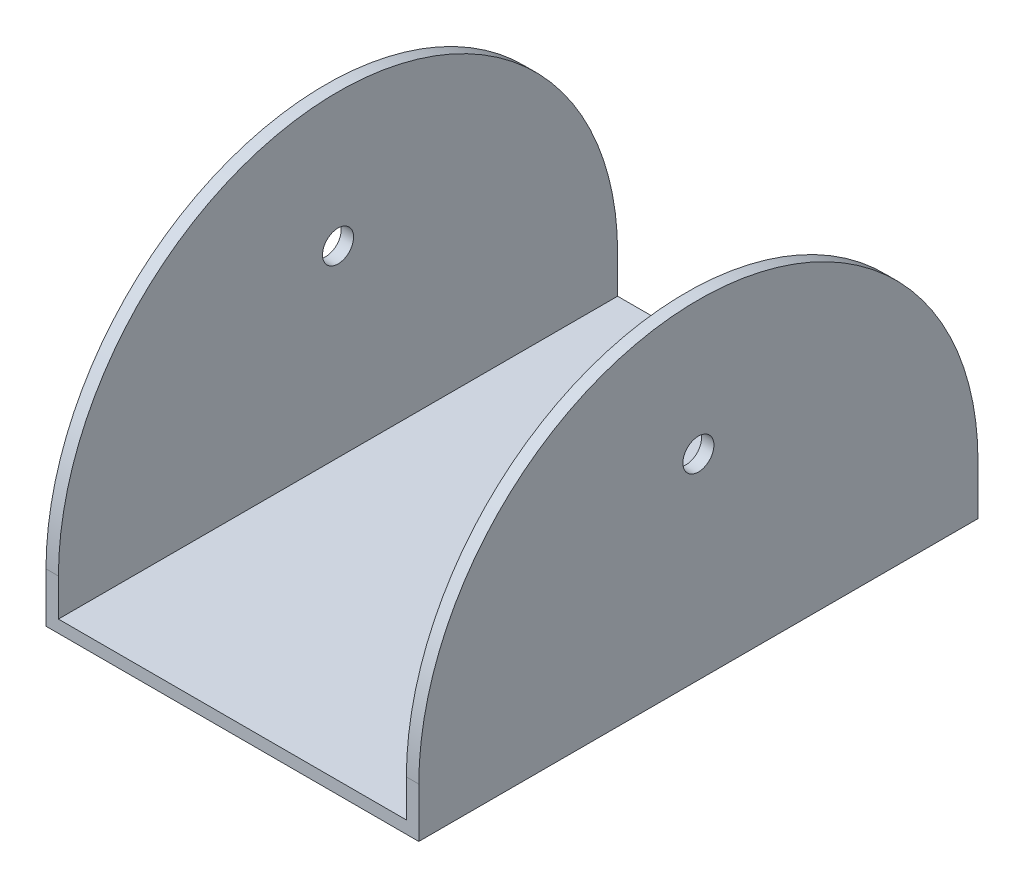
ISO-10303-21;
HEADER;
FILE_DESCRIPTION(('STEP AP214'),'2;1');
FILE_NAME('part.step','',(''),(''),'','','');
FILE_SCHEMA(('AUTOMOTIVE_DESIGN { 1 0 10303 214 1 1 1 1 }'));
ENDSEC;
DATA;
#1=APPLICATION_CONTEXT('core data for automotive mechanical design processes');
#2=APPLICATION_PROTOCOL_DEFINITION('international standard','automotive_design',2000,#1);
#3=PRODUCT_CONTEXT('',#1,'mechanical');
#4=PRODUCT('Part','Part','',(#3));
#5=PRODUCT_RELATED_PRODUCT_CATEGORY('part','',(#4));
#6=PRODUCT_DEFINITION_FORMATION('','',#4);
#7=PRODUCT_DEFINITION_CONTEXT('part definition',#1,'design');
#8=PRODUCT_DEFINITION('design','',#6,#7);
#9=PRODUCT_DEFINITION_SHAPE('','',#8);
#10=(LENGTH_UNIT() NAMED_UNIT(*) SI_UNIT(.MILLI.,.METRE.));
#11=(NAMED_UNIT(*) PLANE_ANGLE_UNIT() SI_UNIT($,.RADIAN.));
#12=(NAMED_UNIT(*) SI_UNIT($,.STERADIAN.) SOLID_ANGLE_UNIT());
#13=UNCERTAINTY_MEASURE_WITH_UNIT(LENGTH_MEASURE(1.E-05),#10,'distance_accuracy_value','');
#14=(GEOMETRIC_REPRESENTATION_CONTEXT(3) GLOBAL_UNCERTAINTY_ASSIGNED_CONTEXT((#13)) GLOBAL_UNIT_ASSIGNED_CONTEXT((#10,
#11,#12)) REPRESENTATION_CONTEXT('',''));
#15=CARTESIAN_POINT('',(0.,0.,0.));
#16=DIRECTION('',(0.,0.,1.));
#17=DIRECTION('',(1.,0.,0.));
#18=AXIS2_PLACEMENT_3D('',#15,#16,#17);
#19=CARTESIAN_POINT('',(-30.,-4.98349643765029,-45.));
#20=DIRECTION('',(-1.,0.,0.));
#21=DIRECTION('',(0.,-1.,0.));
#22=AXIS2_PLACEMENT_3D('',#19,#20,#21);
#23=PLANE('',#22);
#24=CARTESIAN_POINT('',(-30.,26.5165035623497,0.));
#25=DIRECTION('',(-1.,0.,0.));
#26=DIRECTION('',(0.,0.,1.));
#27=AXIS2_PLACEMENT_3D('',#24,#25,#26);
#28=CIRCLE('',#27,2.5);
#29=CARTESIAN_POINT('',(-30.,26.5165035623497,2.5));
#30=VERTEX_POINT('',#29);
#31=EDGE_CURVE('E206',#30,#30,#28,.T.);
#32=ORIENTED_EDGE('',*,*,#31,.F.);
#33=EDGE_LOOP('',(#32));
#34=FACE_BOUND('',#33,.T.);
#35=CARTESIAN_POINT('',(-30.,3.0165035623497,0.));
#36=DIRECTION('',(1.,0.,0.));
#37=DIRECTION('',(0.,1.,0.));
#38=AXIS2_PLACEMENT_3D('',#35,#36,#37);
#39=CIRCLE('',#38,45.);
#40=CARTESIAN_POINT('',(-30.,3.0165035623497,45.));
#41=VERTEX_POINT('',#40);
#42=CARTESIAN_POINT('',(-30.,3.0165035623497,-45.));
#43=VERTEX_POINT('',#42);
#44=EDGE_CURVE('E60',#41,#43,#39,.F.);
#45=ORIENTED_EDGE('',*,*,#44,.T.);
#46=DIRECTION('',(0.,-1.,0.));
#47=VECTOR('',#46,1.);
#48=CARTESIAN_POINT('',(-30.,-4.98349643765029,-45.));
#49=LINE('',#48,#47);
#50=CARTESIAN_POINT('',(-30.,-4.98349643765029,-45.));
#51=VERTEX_POINT('',#50);
#52=EDGE_CURVE('E103',#43,#51,#49,.T.);
#53=ORIENTED_EDGE('',*,*,#52,.T.);
#54=DIRECTION('',(0.,0.,1.));
#55=VECTOR('',#54,1.);
#56=CARTESIAN_POINT('',(-30.,-4.98349643765029,-45.));
#57=LINE('',#56,#55);
#58=CARTESIAN_POINT('',(-30.,-4.98349643765029,45.));
#59=VERTEX_POINT('',#58);
#60=EDGE_CURVE('E152',#51,#59,#57,.T.);
#61=ORIENTED_EDGE('',*,*,#60,.T.);
#62=DIRECTION('',(0.,-1.,0.));
#63=VECTOR('',#62,1.);
#64=CARTESIAN_POINT('',(-30.,-4.98349643765029,45.));
#65=LINE('',#64,#63);
#66=EDGE_CURVE('E105',#41,#59,#65,.T.);
#67=ORIENTED_EDGE('',*,*,#66,.F.);
#68=EDGE_LOOP('',(#45,#53,#61,#67));
#69=FACE_BOUND('',#68,.T.);
#70=ADVANCED_FACE('F38',(#34,#69),#23,.T.);
#71=CARTESIAN_POINT('',(-28.,48.0165035623497,-45.));
#72=DIRECTION('',(1.,0.,0.));
#73=DIRECTION('',(0.,1.,0.));
#74=AXIS2_PLACEMENT_3D('',#71,#72,#73);
#75=PLANE('',#74);
#76=CARTESIAN_POINT('',(-28.,26.5165035623497,0.));
#77=DIRECTION('',(1.,0.,0.));
#78=DIRECTION('',(0.,1.,0.));
#79=AXIS2_PLACEMENT_3D('',#76,#77,#78);
#80=CIRCLE('',#79,2.5);
#81=CARTESIAN_POINT('',(-28.,29.0165035623497,0.));
#82=VERTEX_POINT('',#81);
#83=EDGE_CURVE('E119',#82,#82,#80,.T.);
#84=ORIENTED_EDGE('',*,*,#83,.F.);
#85=EDGE_LOOP('',(#84));
#86=FACE_BOUND('',#85,.T.);
#87=DIRECTION('',(0.,1.,0.));
#88=VECTOR('',#87,1.);
#89=CARTESIAN_POINT('',(-28.,48.0165035623497,-45.));
#90=LINE('',#89,#88);
#91=CARTESIAN_POINT('',(-28.,-2.98349643765029,-45.));
#92=VERTEX_POINT('',#91);
#93=CARTESIAN_POINT('',(-28.,3.0165035623497,-45.));
#94=VERTEX_POINT('',#93);
#95=EDGE_CURVE('E149',#92,#94,#90,.T.);
#96=ORIENTED_EDGE('',*,*,#95,.T.);
#97=CARTESIAN_POINT('',(-28.,3.0165035623497,0.));
#98=DIRECTION('',(1.,0.,0.));
#99=DIRECTION('',(0.,1.,0.));
#100=AXIS2_PLACEMENT_3D('',#97,#98,#99);
#101=CIRCLE('',#100,45.);
#102=CARTESIAN_POINT('',(-28.,3.0165035623497,45.));
#103=VERTEX_POINT('',#102);
#104=EDGE_CURVE('E114',#103,#94,#101,.F.);
#105=ORIENTED_EDGE('',*,*,#104,.F.);
#106=DIRECTION('',(0.,1.,0.));
#107=VECTOR('',#106,1.);
#108=CARTESIAN_POINT('',(-28.,48.0165035623497,45.));
#109=LINE('',#108,#107);
#110=CARTESIAN_POINT('',(-28.,-2.98349643765029,45.));
#111=VERTEX_POINT('',#110);
#112=EDGE_CURVE('E128',#111,#103,#109,.T.);
#113=ORIENTED_EDGE('',*,*,#112,.F.);
#114=DIRECTION('',(0.,0.,1.));
#115=VECTOR('',#114,1.);
#116=CARTESIAN_POINT('',(-28.,-2.98349643765029,-45.));
#117=LINE('',#116,#115);
#118=EDGE_CURVE('E153',#92,#111,#117,.T.);
#119=ORIENTED_EDGE('',*,*,#118,.F.);
#120=EDGE_LOOP('',(#96,#105,#113,#119));
#121=FACE_BOUND('',#120,.T.);
#122=ADVANCED_FACE('F237',(#86,#121),#75,.T.);
#123=CARTESIAN_POINT('',(28.,48.0165035623497,-45.));
#124=DIRECTION('',(-1.,0.,0.));
#125=DIRECTION('',(0.,-1.,0.));
#126=AXIS2_PLACEMENT_3D('',#123,#124,#125);
#127=PLANE('',#126);
#128=CARTESIAN_POINT('',(28.,26.5165035623497,0.));
#129=DIRECTION('',(-1.,0.,0.));
#130=DIRECTION('',(0.,-1.,0.));
#131=AXIS2_PLACEMENT_3D('',#128,#129,#130);
#132=CIRCLE('',#131,2.5);
#133=CARTESIAN_POINT('',(28.,24.0165035623497,0.));
#134=VERTEX_POINT('',#133);
#135=EDGE_CURVE('E201',#134,#134,#132,.T.);
#136=ORIENTED_EDGE('',*,*,#135,.F.);
#137=EDGE_LOOP('',(#136));
#138=FACE_BOUND('',#137,.T.);
#139=CARTESIAN_POINT('',(28.,3.01650356234972,0.));
#140=DIRECTION('',(-1.,0.,0.));
#141=DIRECTION('',(0.,-1.,0.));
#142=AXIS2_PLACEMENT_3D('',#139,#140,#141);
#143=CIRCLE('',#142,45.);
#144=CARTESIAN_POINT('',(28.,3.01650356234972,-45.));
#145=VERTEX_POINT('',#144);
#146=CARTESIAN_POINT('',(28.,3.01650356234971,45.));
#147=VERTEX_POINT('',#146);
#148=EDGE_CURVE('E52',#145,#147,#143,.F.);
#149=ORIENTED_EDGE('',*,*,#148,.F.);
#150=DIRECTION('',(0.,-1.,0.));
#151=VECTOR('',#150,1.);
#152=CARTESIAN_POINT('',(28.,48.0165035623497,-45.));
#153=LINE('',#152,#151);
#154=CARTESIAN_POINT('',(28.,-2.98349643765028,-45.));
#155=VERTEX_POINT('',#154);
#156=EDGE_CURVE('E142',#145,#155,#153,.T.);
#157=ORIENTED_EDGE('',*,*,#156,.T.);
#158=DIRECTION('',(0.,0.,1.));
#159=VECTOR('',#158,1.);
#160=CARTESIAN_POINT('',(28.,-2.98349643765028,-45.));
#161=LINE('',#160,#159);
#162=CARTESIAN_POINT('',(28.,-2.98349643765028,45.));
#163=VERTEX_POINT('',#162);
#164=EDGE_CURVE('E156',#155,#163,#161,.T.);
#165=ORIENTED_EDGE('',*,*,#164,.T.);
#166=DIRECTION('',(0.,-1.,0.));
#167=VECTOR('',#166,1.);
#168=CARTESIAN_POINT('',(28.,48.0165035623497,45.));
#169=LINE('',#168,#167);
#170=EDGE_CURVE('E170',#147,#163,#169,.T.);
#171=ORIENTED_EDGE('',*,*,#170,.F.);
#172=EDGE_LOOP('',(#149,#157,#165,#171));
#173=FACE_BOUND('',#172,.T.);
#174=ADVANCED_FACE('F176',(#138,#173),#127,.T.);
#175=CARTESIAN_POINT('',(30.,-4.98349643765028,-45.));
#176=DIRECTION('',(1.,0.,0.));
#177=DIRECTION('',(0.,1.,0.));
#178=AXIS2_PLACEMENT_3D('',#175,#176,#177);
#179=PLANE('',#178);
#180=CARTESIAN_POINT('',(30.,26.5165035623497,0.));
#181=DIRECTION('',(-1.,0.,0.));
#182=DIRECTION('',(0.,0.,1.));
#183=AXIS2_PLACEMENT_3D('',#180,#181,#182);
#184=CIRCLE('',#183,2.5);
#185=CARTESIAN_POINT('',(30.,26.5165035623497,2.5));
#186=VERTEX_POINT('',#185);
#187=EDGE_CURVE('E205',#186,#186,#184,.T.);
#188=ORIENTED_EDGE('',*,*,#187,.T.);
#189=EDGE_LOOP('',(#188));
#190=FACE_BOUND('',#189,.T.);
#191=DIRECTION('',(0.,1.,0.));
#192=VECTOR('',#191,1.);
#193=CARTESIAN_POINT('',(30.,-4.98349643765028,-45.));
#194=LINE('',#193,#192);
#195=CARTESIAN_POINT('',(30.,-4.98349643765028,-45.));
#196=VERTEX_POINT('',#195);
#197=CARTESIAN_POINT('',(30.,3.01650356234972,-45.));
#198=VERTEX_POINT('',#197);
#199=EDGE_CURVE('E132',#196,#198,#194,.T.);
#200=ORIENTED_EDGE('',*,*,#199,.T.);
#201=CARTESIAN_POINT('',(30.,3.01650356234972,0.));
#202=DIRECTION('',(1.,0.,0.));
#203=DIRECTION('',(0.,1.,0.));
#204=AXIS2_PLACEMENT_3D('',#201,#202,#203);
#205=CIRCLE('',#204,45.);
#206=CARTESIAN_POINT('',(30.,3.01650356234972,45.));
#207=VERTEX_POINT('',#206);
#208=EDGE_CURVE('E108',#207,#198,#205,.F.);
#209=ORIENTED_EDGE('',*,*,#208,.F.);
#210=DIRECTION('',(0.,1.,0.));
#211=VECTOR('',#210,1.);
#212=CARTESIAN_POINT('',(30.,-4.98349643765028,45.));
#213=LINE('',#212,#211);
#214=CARTESIAN_POINT('',(30.,-4.98349643765028,45.));
#215=VERTEX_POINT('',#214);
#216=EDGE_CURVE('E173',#215,#207,#213,.T.);
#217=ORIENTED_EDGE('',*,*,#216,.F.);
#218=DIRECTION('',(0.,0.,1.));
#219=VECTOR('',#218,1.);
#220=CARTESIAN_POINT('',(30.,-4.98349643765028,-45.));
#221=LINE('',#220,#219);
#222=EDGE_CURVE('E160',#196,#215,#221,.T.);
#223=ORIENTED_EDGE('',*,*,#222,.F.);
#224=EDGE_LOOP('',(#200,#209,#217,#223));
#225=FACE_BOUND('',#224,.T.);
#226=ADVANCED_FACE('F230',(#190,#225),#179,.T.);
#227=CARTESIAN_POINT('',(-28.,-2.98349643765029,-45.));
#228=DIRECTION('',(0.,1.,0.));
#229=DIRECTION('',(-1.,0.,0.));
#230=AXIS2_PLACEMENT_3D('',#227,#228,#229);
#231=PLANE('',#230);
#232=CARTESIAN_POINT('',(0.,-2.98349643765029,0.));
#233=DIRECTION('',(0.,1.,0.));
#234=DIRECTION('',(-1.,0.,0.));
#235=AXIS2_PLACEMENT_3D('',#232,#233,#234);
#236=CIRCLE('',#235,4.);
#237=CARTESIAN_POINT('',(-4.,-2.98349643765029,0.));
#238=VERTEX_POINT('',#237);
#239=EDGE_CURVE('E210',#238,#238,#236,.T.);
#240=ORIENTED_EDGE('',*,*,#239,.F.);
#241=EDGE_LOOP('',(#240));
#242=FACE_BOUND('',#241,.T.);
#243=ORIENTED_EDGE('',*,*,#118,.T.);
#244=DIRECTION('',(-1.,0.,0.));
#245=VECTOR('',#244,1.);
#246=CARTESIAN_POINT('',(-28.,-2.98349643765029,45.));
#247=LINE('',#246,#245);
#248=EDGE_CURVE('E135',#163,#111,#247,.T.);
#249=ORIENTED_EDGE('',*,*,#248,.F.);
#250=ORIENTED_EDGE('',*,*,#164,.F.);
#251=DIRECTION('',(-1.,0.,0.));
#252=VECTOR('',#251,1.);
#253=CARTESIAN_POINT('',(-28.,-2.98349643765029,-45.));
#254=LINE('',#253,#252);
#255=EDGE_CURVE('E145',#155,#92,#254,.T.);
#256=ORIENTED_EDGE('',*,*,#255,.T.);
#257=EDGE_LOOP('',(#243,#249,#250,#256));
#258=FACE_BOUND('',#257,.T.);
#259=ADVANCED_FACE('F227',(#242,#258),#231,.T.);
#260=CARTESIAN_POINT('',(30.,-4.98349643765028,-45.));
#261=DIRECTION('',(0.,-1.,0.));
#262=DIRECTION('',(1.,0.,0.));
#263=AXIS2_PLACEMENT_3D('',#260,#261,#262);
#264=PLANE('',#263);
#265=CARTESIAN_POINT('',(0.,-4.98349643765029,0.));
#266=DIRECTION('',(0.,-1.,0.));
#267=DIRECTION('',(1.,0.,0.));
#268=AXIS2_PLACEMENT_3D('',#265,#266,#267);
#269=CIRCLE('',#268,4.);
#270=CARTESIAN_POINT('',(4.,-4.98349643765029,0.));
#271=VERTEX_POINT('',#270);
#272=EDGE_CURVE('E217',#271,#271,#269,.T.);
#273=ORIENTED_EDGE('',*,*,#272,.F.);
#274=EDGE_LOOP('',(#273));
#275=FACE_BOUND('',#274,.T.);
#276=ORIENTED_EDGE('',*,*,#222,.T.);
#277=DIRECTION('',(1.,0.,0.));
#278=VECTOR('',#277,1.);
#279=CARTESIAN_POINT('',(30.,-4.98349643765028,45.));
#280=LINE('',#279,#278);
#281=EDGE_CURVE('E183',#59,#215,#280,.T.);
#282=ORIENTED_EDGE('',*,*,#281,.F.);
#283=ORIENTED_EDGE('',*,*,#60,.F.);
#284=DIRECTION('',(1.,0.,0.));
#285=VECTOR('',#284,1.);
#286=CARTESIAN_POINT('',(30.,-4.98349643765028,-45.));
#287=LINE('',#286,#285);
#288=EDGE_CURVE('E126',#51,#196,#287,.T.);
#289=ORIENTED_EDGE('',*,*,#288,.T.);
#290=EDGE_LOOP('',(#276,#282,#283,#289));
#291=FACE_BOUND('',#290,.T.);
#292=ADVANCED_FACE('F224',(#275,#291),#264,.T.);
#293=CARTESIAN_POINT('',(0.,0.,-45.));
#294=DIRECTION('',(0.,0.,-1.));
#295=DIRECTION('',(-1.,0.,0.));
#296=AXIS2_PLACEMENT_3D('',#293,#294,#295);
#297=PLANE('',#296);
#298=DIRECTION('',(1.,0.,0.));
#299=VECTOR('',#298,1.);
#300=CARTESIAN_POINT('',(-30.,3.0165035623497,-45.));
#301=LINE('',#300,#299);
#302=EDGE_CURVE('E11',#198,#145,#301,.F.);
#303=ORIENTED_EDGE('',*,*,#302,.F.);
#304=ORIENTED_EDGE('',*,*,#199,.F.);
#305=ORIENTED_EDGE('',*,*,#288,.F.);
#306=ORIENTED_EDGE('',*,*,#52,.F.);
#307=DIRECTION('',(1.,0.,0.));
#308=VECTOR('',#307,1.);
#309=CARTESIAN_POINT('',(-30.,3.0165035623497,-45.));
#310=LINE('',#309,#308);
#311=EDGE_CURVE('E111',#43,#94,#310,.T.);
#312=ORIENTED_EDGE('',*,*,#311,.T.);
#313=ORIENTED_EDGE('',*,*,#95,.F.);
#314=ORIENTED_EDGE('',*,*,#255,.F.);
#315=ORIENTED_EDGE('',*,*,#156,.F.);
#316=EDGE_LOOP('',(#303,#304,#305,#306,#312,#313,#314,#315));
#317=FACE_BOUND('',#316,.T.);
#318=ADVANCED_FACE('F123',(#317),#297,.T.);
#319=CARTESIAN_POINT('',(0.,0.,45.));
#320=DIRECTION('',(0.,0.,-1.));
#321=DIRECTION('',(-1.,0.,0.));
#322=AXIS2_PLACEMENT_3D('',#319,#320,#321);
#323=PLANE('',#322);
#324=ORIENTED_EDGE('',*,*,#216,.T.);
#325=DIRECTION('',(1.,0.,0.));
#326=VECTOR('',#325,1.);
#327=CARTESIAN_POINT('',(-30.,3.0165035623497,45.));
#328=LINE('',#327,#326);
#329=EDGE_CURVE('E46',#207,#147,#328,.F.);
#330=ORIENTED_EDGE('',*,*,#329,.T.);
#331=ORIENTED_EDGE('',*,*,#170,.T.);
#332=ORIENTED_EDGE('',*,*,#248,.T.);
#333=ORIENTED_EDGE('',*,*,#112,.T.);
#334=DIRECTION('',(1.,0.,0.));
#335=VECTOR('',#334,1.);
#336=CARTESIAN_POINT('',(-30.,3.0165035623497,45.));
#337=LINE('',#336,#335);
#338=EDGE_CURVE('E107',#41,#103,#337,.T.);
#339=ORIENTED_EDGE('',*,*,#338,.F.);
#340=ORIENTED_EDGE('',*,*,#66,.T.);
#341=ORIENTED_EDGE('',*,*,#281,.T.);
#342=EDGE_LOOP('',(#324,#330,#331,#332,#333,#339,#340,#341));
#343=FACE_BOUND('',#342,.T.);
#344=ADVANCED_FACE('F168',(#343),#323,.F.);
#345=CARTESIAN_POINT('',(-30.,3.0165035623497,0.));
#346=DIRECTION('',(1.,0.,0.));
#347=DIRECTION('',(0.,1.,0.));
#348=AXIS2_PLACEMENT_3D('',#345,#346,#347);
#349=CYLINDRICAL_SURFACE('',#348,45.);
#350=ORIENTED_EDGE('',*,*,#104,.T.);
#351=ORIENTED_EDGE('',*,*,#311,.F.);
#352=ORIENTED_EDGE('',*,*,#44,.F.);
#353=ORIENTED_EDGE('',*,*,#338,.T.);
#354=EDGE_LOOP('',(#350,#351,#352,#353));
#355=FACE_BOUND('',#354,.T.);
#356=ADVANCED_FACE('F112',(#355),#349,.T.);
#357=ORIENTED_EDGE('',*,*,#148,.T.);
#358=ORIENTED_EDGE('',*,*,#329,.F.);
#359=ORIENTED_EDGE('',*,*,#208,.T.);
#360=ORIENTED_EDGE('',*,*,#302,.T.);
#361=EDGE_LOOP('',(#357,#358,#359,#360));
#362=FACE_BOUND('',#361,.T.);
#363=ADVANCED_FACE('F231',(#362),#349,.T.);
#364=CARTESIAN_POINT('',(30.,26.5165035623497,0.));
#365=DIRECTION('',(-1.,0.,0.));
#366=DIRECTION('',(0.,0.,1.));
#367=AXIS2_PLACEMENT_3D('',#364,#365,#366);
#368=CYLINDRICAL_SURFACE('',#367,2.5);
#369=ORIENTED_EDGE('',*,*,#135,.T.);
#370=EDGE_LOOP('',(#369));
#371=FACE_BOUND('',#370,.T.);
#372=ORIENTED_EDGE('',*,*,#187,.F.);
#373=EDGE_LOOP('',(#372));
#374=FACE_BOUND('',#373,.T.);
#375=ADVANCED_FACE('F262',(#371,#374),#368,.F.);
#376=ORIENTED_EDGE('',*,*,#83,.T.);
#377=EDGE_LOOP('',(#376));
#378=FACE_BOUND('',#377,.T.);
#379=ORIENTED_EDGE('',*,*,#31,.T.);
#380=EDGE_LOOP('',(#379));
#381=FACE_BOUND('',#380,.T.);
#382=ADVANCED_FACE('F264',(#378,#381),#368,.F.);
#383=CARTESIAN_POINT('',(0.,45.0165035623497,0.));
#384=DIRECTION('',(0.,-1.,0.));
#385=DIRECTION('',(1.,0.,0.));
#386=AXIS2_PLACEMENT_3D('',#383,#384,#385);
#387=CYLINDRICAL_SURFACE('',#386,4.);
#388=ORIENTED_EDGE('',*,*,#239,.T.);
#389=EDGE_LOOP('',(#388));
#390=FACE_BOUND('',#389,.T.);
#391=ORIENTED_EDGE('',*,*,#272,.T.);
#392=EDGE_LOOP('',(#391));
#393=FACE_BOUND('',#392,.T.);
#394=ADVANCED_FACE('F222',(#390,#393),#387,.F.);
#395=CLOSED_SHELL('',(#70,#122,#174,#226,#259,#292,#318,#344,#356,#363,#375,#382,#394));
#396=MANIFOLD_SOLID_BREP('B2',#395);
#397=ADVANCED_BREP_SHAPE_REPRESENTATION('',(#18,#396),#14);
#398=SHAPE_DEFINITION_REPRESENTATION(#9,#397);
ENDSEC;
END-ISO-10303-21;
